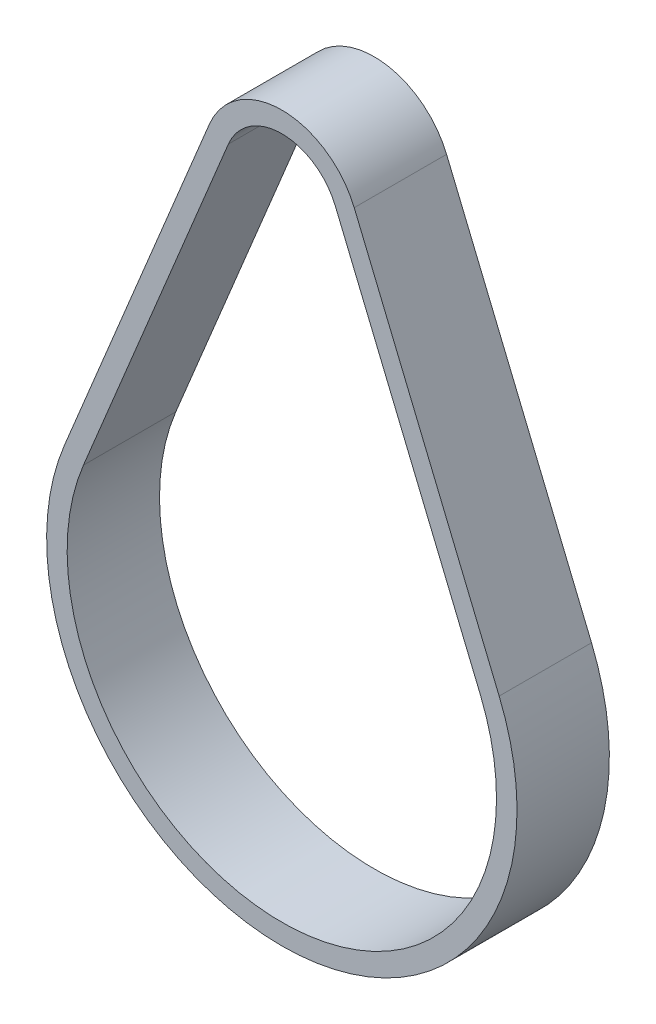
ISO-10303-21;
HEADER;
FILE_DESCRIPTION(('STEP AP214'),'2;1');
FILE_NAME('part.step','',(''),(''),'','','');
FILE_SCHEMA(('AUTOMOTIVE_DESIGN { 1 0 10303 214 1 1 1 1 }'));
ENDSEC;
DATA;
#1=APPLICATION_CONTEXT('core data for automotive mechanical design processes');
#2=APPLICATION_PROTOCOL_DEFINITION('international standard','automotive_design',2000,#1);
#3=PRODUCT_CONTEXT('',#1,'mechanical');
#4=PRODUCT('Part','Part','',(#3));
#5=PRODUCT_RELATED_PRODUCT_CATEGORY('part','',(#4));
#6=PRODUCT_DEFINITION_FORMATION('','',#4);
#7=PRODUCT_DEFINITION_CONTEXT('part definition',#1,'design');
#8=PRODUCT_DEFINITION('design','',#6,#7);
#9=PRODUCT_DEFINITION_SHAPE('','',#8);
#10=(LENGTH_UNIT() NAMED_UNIT(*) SI_UNIT(.MILLI.,.METRE.));
#11=(NAMED_UNIT(*) PLANE_ANGLE_UNIT() SI_UNIT($,.RADIAN.));
#12=(NAMED_UNIT(*) SI_UNIT($,.STERADIAN.) SOLID_ANGLE_UNIT());
#13=UNCERTAINTY_MEASURE_WITH_UNIT(LENGTH_MEASURE(1.E-05),#10,'distance_accuracy_value','');
#14=(GEOMETRIC_REPRESENTATION_CONTEXT(3) GLOBAL_UNCERTAINTY_ASSIGNED_CONTEXT((#13)) GLOBAL_UNIT_ASSIGNED_CONTEXT((#10,
#11,#12)) REPRESENTATION_CONTEXT('',''));
#15=CARTESIAN_POINT('',(0.,0.,0.));
#16=DIRECTION('',(0.,0.,1.));
#17=DIRECTION('',(1.,0.,0.));
#18=AXIS2_PLACEMENT_3D('',#15,#16,#17);
#19=CARTESIAN_POINT('',(0.,0.,4.5));
#20=DIRECTION('',(0.,0.,1.));
#21=DIRECTION('',(1.,0.,0.));
#22=AXIS2_PLACEMENT_3D('',#19,#20,#21);
#23=PLANE('',#22);
#24=CARTESIAN_POINT('',(0.,0.,4.5));
#25=DIRECTION('',(0.,0.,1.));
#26=DIRECTION('',(1.,0.,0.));
#27=AXIS2_PLACEMENT_3D('',#24,#25,#26);
#28=CIRCLE('',#27,7.635);
#29=CARTESIAN_POINT('',(7.05558477528836,2.917524375,4.5));
#30=VERTEX_POINT('',#29);
#31=CARTESIAN_POINT('',(-7.05558477528836,2.917524375,4.5));
#32=VERTEX_POINT('',#31);
#33=EDGE_CURVE('E164',#30,#32,#28,.T.);
#34=ORIENTED_EDGE('',*,*,#33,.T.);
#35=DIRECTION('',(-0.382125,-0.924110645093432,0.));
#36=VECTOR('',#35,1.);
#37=CARTESIAN_POINT('',(-7.05558477528836,2.917524375,4.5));
#38=LINE('',#37,#36);
#39=CARTESIAN_POINT('',(-21.1806159855415,-31.241695,4.5));
#40=VERTEX_POINT('',#39);
#41=EDGE_CURVE('E167',#32,#40,#38,.T.);
#42=ORIENTED_EDGE('',*,*,#41,.T.);
#43=CARTESIAN_POINT('',(0.,-40.,4.5));
#44=DIRECTION('',(0.,0.,1.));
#45=DIRECTION('',(1.,0.,0.));
#46=AXIS2_PLACEMENT_3D('',#43,#44,#45);
#47=CIRCLE('',#46,22.92);
#48=CARTESIAN_POINT('',(21.1806159855415,-31.241695,4.5));
#49=VERTEX_POINT('',#48);
#50=EDGE_CURVE('E170',#40,#49,#47,.T.);
#51=ORIENTED_EDGE('',*,*,#50,.T.);
#52=DIRECTION('',(-0.382125,0.924110645093432,0.));
#53=VECTOR('',#52,1.);
#54=CARTESIAN_POINT('',(7.05558477528836,2.917524375,4.5));
#55=LINE('',#54,#53);
#56=EDGE_CURVE('E172',#49,#30,#55,.T.);
#57=ORIENTED_EDGE('',*,*,#56,.T.);
#58=EDGE_LOOP('',(#34,#42,#51,#57));
#59=FACE_BOUND('',#58,.T.);
#60=DIRECTION('',(-0.382125,-0.924110645093433,0.));
#61=VECTOR('',#60,1.);
#62=CARTESIAN_POINT('',(-5.20736348510149,2.153274375,4.5));
#63=LINE('',#62,#61);
#64=CARTESIAN_POINT('',(-5.20736348510149,2.153274375,4.5));
#65=VERTEX_POINT('',#64);
#66=CARTESIAN_POINT('',(-19.3323946953546,-32.005945,4.5));
#67=VERTEX_POINT('',#66);
#68=EDGE_CURVE('E136',#65,#67,#63,.T.);
#69=ORIENTED_EDGE('',*,*,#68,.F.);
#70=CARTESIAN_POINT('',(0.,0.,4.5));
#71=DIRECTION('',(0.,0.,1.));
#72=DIRECTION('',(1.,0.,0.));
#73=AXIS2_PLACEMENT_3D('',#70,#71,#72);
#74=CIRCLE('',#73,5.635);
#75=CARTESIAN_POINT('',(5.20736348510149,2.153274375,4.5));
#76=VERTEX_POINT('',#75);
#77=EDGE_CURVE('E128',#76,#65,#74,.T.);
#78=ORIENTED_EDGE('',*,*,#77,.F.);
#79=DIRECTION('',(-0.382125,0.924110645093433,0.));
#80=VECTOR('',#79,1.);
#81=CARTESIAN_POINT('',(5.20736348510149,2.153274375,4.5));
#82=LINE('',#81,#80);
#83=CARTESIAN_POINT('',(19.3323946953546,-32.005945,4.5));
#84=VERTEX_POINT('',#83);
#85=EDGE_CURVE('E150',#84,#76,#82,.T.);
#86=ORIENTED_EDGE('',*,*,#85,.F.);
#87=CARTESIAN_POINT('',(0.,-40.,4.5));
#88=DIRECTION('',(0.,0.,1.));
#89=DIRECTION('',(1.,0.,0.));
#90=AXIS2_PLACEMENT_3D('',#87,#88,#89);
#91=CIRCLE('',#90,20.92);
#92=EDGE_CURVE('E148',#67,#84,#91,.T.);
#93=ORIENTED_EDGE('',*,*,#92,.F.);
#94=EDGE_LOOP('',(#69,#78,#86,#93));
#95=FACE_BOUND('',#94,.T.);
#96=ADVANCED_FACE('F63',(#59,#95),#23,.T.);
#97=CARTESIAN_POINT('',(0.,0.,-4.5));
#98=DIRECTION('',(0.,0.,1.));
#99=DIRECTION('',(1.,0.,0.));
#100=AXIS2_PLACEMENT_3D('',#97,#98,#99);
#101=PLANE('',#100);
#102=CARTESIAN_POINT('',(0.,0.,-4.5));
#103=DIRECTION('',(0.,0.,1.));
#104=DIRECTION('',(1.,0.,0.));
#105=AXIS2_PLACEMENT_3D('',#102,#103,#104);
#106=CIRCLE('',#105,7.635);
#107=CARTESIAN_POINT('',(7.05558477528836,2.917524375,-4.5));
#108=VERTEX_POINT('',#107);
#109=CARTESIAN_POINT('',(-7.05558477528836,2.917524375,-4.5));
#110=VERTEX_POINT('',#109);
#111=EDGE_CURVE('E144',#108,#110,#106,.T.);
#112=ORIENTED_EDGE('',*,*,#111,.F.);
#113=DIRECTION('',(-0.382125,0.924110645093432,0.));
#114=VECTOR('',#113,1.);
#115=CARTESIAN_POINT('',(7.05558477528836,2.917524375,-4.5));
#116=LINE('',#115,#114);
#117=CARTESIAN_POINT('',(21.1806159855415,-31.241695,-4.5));
#118=VERTEX_POINT('',#117);
#119=EDGE_CURVE('E168',#118,#108,#116,.T.);
#120=ORIENTED_EDGE('',*,*,#119,.F.);
#121=CARTESIAN_POINT('',(0.,-40.,-4.5));
#122=DIRECTION('',(0.,0.,1.));
#123=DIRECTION('',(1.,0.,0.));
#124=AXIS2_PLACEMENT_3D('',#121,#122,#123);
#125=CIRCLE('',#124,22.92);
#126=CARTESIAN_POINT('',(-21.1806159855415,-31.241695,-4.5));
#127=VERTEX_POINT('',#126);
#128=EDGE_CURVE('E179',#127,#118,#125,.T.);
#129=ORIENTED_EDGE('',*,*,#128,.F.);
#130=DIRECTION('',(-0.382125,-0.924110645093432,0.));
#131=VECTOR('',#130,1.);
#132=CARTESIAN_POINT('',(-7.05558477528836,2.917524375,-4.5));
#133=LINE('',#132,#131);
#134=EDGE_CURVE('E177',#110,#127,#133,.T.);
#135=ORIENTED_EDGE('',*,*,#134,.F.);
#136=EDGE_LOOP('',(#112,#120,#129,#135));
#137=FACE_BOUND('',#136,.T.);
#138=CARTESIAN_POINT('',(0.,0.,-4.5));
#139=DIRECTION('',(0.,0.,1.));
#140=DIRECTION('',(1.,0.,0.));
#141=AXIS2_PLACEMENT_3D('',#138,#139,#140);
#142=CIRCLE('',#141,5.635);
#143=CARTESIAN_POINT('',(5.20736348510149,2.153274375,-4.5));
#144=VERTEX_POINT('',#143);
#145=CARTESIAN_POINT('',(-5.20736348510149,2.153274375,-4.5));
#146=VERTEX_POINT('',#145);
#147=EDGE_CURVE('E86',#144,#146,#142,.T.);
#148=ORIENTED_EDGE('',*,*,#147,.T.);
#149=DIRECTION('',(-0.382125,-0.924110645093433,0.));
#150=VECTOR('',#149,1.);
#151=CARTESIAN_POINT('',(-5.20736348510149,2.153274375,-4.5));
#152=LINE('',#151,#150);
#153=CARTESIAN_POINT('',(-19.3323946953546,-32.005945,-4.5));
#154=VERTEX_POINT('',#153);
#155=EDGE_CURVE('E143',#146,#154,#152,.T.);
#156=ORIENTED_EDGE('',*,*,#155,.T.);
#157=CARTESIAN_POINT('',(0.,-40.,-4.5));
#158=DIRECTION('',(0.,0.,1.));
#159=DIRECTION('',(1.,0.,0.));
#160=AXIS2_PLACEMENT_3D('',#157,#158,#159);
#161=CIRCLE('',#160,20.92);
#162=CARTESIAN_POINT('',(19.3323946953546,-32.005945,-4.5));
#163=VERTEX_POINT('',#162);
#164=EDGE_CURVE('E156',#154,#163,#161,.T.);
#165=ORIENTED_EDGE('',*,*,#164,.T.);
#166=DIRECTION('',(-0.382125,0.924110645093433,0.));
#167=VECTOR('',#166,1.);
#168=CARTESIAN_POINT('',(5.20736348510149,2.153274375,-4.5));
#169=LINE('',#168,#167);
#170=EDGE_CURVE('E137',#163,#144,#169,.T.);
#171=ORIENTED_EDGE('',*,*,#170,.T.);
#172=EDGE_LOOP('',(#148,#156,#165,#171));
#173=FACE_BOUND('',#172,.T.);
#174=ADVANCED_FACE('F197',(#137,#173),#101,.F.);
#175=CARTESIAN_POINT('',(0.,0.,4.5));
#176=DIRECTION('',(0.,0.,-1.));
#177=DIRECTION('',(-1.,0.,0.));
#178=AXIS2_PLACEMENT_3D('',#175,#176,#177);
#179=CYLINDRICAL_SURFACE('',#178,7.635);
#180=ORIENTED_EDGE('',*,*,#111,.T.);
#181=DIRECTION('',(0.,0.,-1.));
#182=VECTOR('',#181,1.);
#183=CARTESIAN_POINT('',(-7.05558477528836,2.917524375,4.5));
#184=LINE('',#183,#182);
#185=EDGE_CURVE('E12',#32,#110,#184,.T.);
#186=ORIENTED_EDGE('',*,*,#185,.F.);
#187=ORIENTED_EDGE('',*,*,#33,.F.);
#188=DIRECTION('',(0.,0.,-1.));
#189=VECTOR('',#188,1.);
#190=CARTESIAN_POINT('',(7.05558477528836,2.917524375,4.5));
#191=LINE('',#190,#189);
#192=EDGE_CURVE('E174',#30,#108,#191,.T.);
#193=ORIENTED_EDGE('',*,*,#192,.T.);
#194=EDGE_LOOP('',(#180,#186,#187,#193));
#195=FACE_BOUND('',#194,.T.);
#196=ADVANCED_FACE('F65',(#195),#179,.T.);
#197=CARTESIAN_POINT('',(-7.05558477528836,2.917524375,4.5));
#198=DIRECTION('',(0.924110645093432,-0.382125,0.));
#199=DIRECTION('',(0.382125,0.924110645093432,0.));
#200=AXIS2_PLACEMENT_3D('',#197,#198,#199);
#201=PLANE('',#200);
#202=ORIENTED_EDGE('',*,*,#134,.T.);
#203=DIRECTION('',(0.,0.,-1.));
#204=VECTOR('',#203,1.);
#205=CARTESIAN_POINT('',(-21.1806159855415,-31.241695,4.5));
#206=LINE('',#205,#204);
#207=EDGE_CURVE('E71',#40,#127,#206,.T.);
#208=ORIENTED_EDGE('',*,*,#207,.F.);
#209=ORIENTED_EDGE('',*,*,#41,.F.);
#210=ORIENTED_EDGE('',*,*,#185,.T.);
#211=EDGE_LOOP('',(#202,#208,#209,#210));
#212=FACE_BOUND('',#211,.T.);
#213=ADVANCED_FACE('F207',(#212),#201,.F.);
#214=CARTESIAN_POINT('',(0.,-40.,4.5));
#215=DIRECTION('',(0.,0.,-1.));
#216=DIRECTION('',(-1.,0.,0.));
#217=AXIS2_PLACEMENT_3D('',#214,#215,#216);
#218=CYLINDRICAL_SURFACE('',#217,22.92);
#219=ORIENTED_EDGE('',*,*,#128,.T.);
#220=DIRECTION('',(0.,0.,-1.));
#221=VECTOR('',#220,1.);
#222=CARTESIAN_POINT('',(21.1806159855415,-31.241695,4.5));
#223=LINE('',#222,#221);
#224=EDGE_CURVE('E184',#49,#118,#223,.T.);
#225=ORIENTED_EDGE('',*,*,#224,.F.);
#226=ORIENTED_EDGE('',*,*,#50,.F.);
#227=ORIENTED_EDGE('',*,*,#207,.T.);
#228=EDGE_LOOP('',(#219,#225,#226,#227));
#229=FACE_BOUND('',#228,.T.);
#230=ADVANCED_FACE('F191',(#229),#218,.T.);
#231=CARTESIAN_POINT('',(7.05558477528836,2.917524375,4.5));
#232=DIRECTION('',(-0.924110645093432,-0.382125,0.));
#233=DIRECTION('',(0.382125,-0.924110645093432,0.));
#234=AXIS2_PLACEMENT_3D('',#231,#232,#233);
#235=PLANE('',#234);
#236=ORIENTED_EDGE('',*,*,#119,.T.);
#237=ORIENTED_EDGE('',*,*,#192,.F.);
#238=ORIENTED_EDGE('',*,*,#56,.F.);
#239=ORIENTED_EDGE('',*,*,#224,.T.);
#240=EDGE_LOOP('',(#236,#237,#238,#239));
#241=FACE_BOUND('',#240,.T.);
#242=ADVANCED_FACE('F201',(#241),#235,.F.);
#243=CARTESIAN_POINT('',(0.,0.,4.5));
#244=DIRECTION('',(0.,0.,-1.));
#245=DIRECTION('',(-1.,0.,0.));
#246=AXIS2_PLACEMENT_3D('',#243,#244,#245);
#247=CYLINDRICAL_SURFACE('',#246,5.635);
#248=ORIENTED_EDGE('',*,*,#147,.F.);
#249=DIRECTION('',(0.,0.,-1.));
#250=VECTOR('',#249,1.);
#251=CARTESIAN_POINT('',(5.20736348510149,2.153274375,4.5));
#252=LINE('',#251,#250);
#253=EDGE_CURVE('E132',#76,#144,#252,.T.);
#254=ORIENTED_EDGE('',*,*,#253,.F.);
#255=ORIENTED_EDGE('',*,*,#77,.T.);
#256=DIRECTION('',(0.,0.,-1.));
#257=VECTOR('',#256,1.);
#258=CARTESIAN_POINT('',(-5.20736348510149,2.153274375,4.5));
#259=LINE('',#258,#257);
#260=EDGE_CURVE('E131',#65,#146,#259,.T.);
#261=ORIENTED_EDGE('',*,*,#260,.T.);
#262=EDGE_LOOP('',(#248,#254,#255,#261));
#263=FACE_BOUND('',#262,.T.);
#264=ADVANCED_FACE('F130',(#263),#247,.F.);
#265=CARTESIAN_POINT('',(-5.20736348510149,2.153274375,4.5));
#266=DIRECTION('',(0.924110645093432,-0.382125,0.));
#267=DIRECTION('',(0.382125,0.924110645093433,0.));
#268=AXIS2_PLACEMENT_3D('',#265,#266,#267);
#269=PLANE('',#268);
#270=ORIENTED_EDGE('',*,*,#155,.F.);
#271=ORIENTED_EDGE('',*,*,#260,.F.);
#272=ORIENTED_EDGE('',*,*,#68,.T.);
#273=DIRECTION('',(0.,0.,-1.));
#274=VECTOR('',#273,1.);
#275=CARTESIAN_POINT('',(-19.3323946953546,-32.005945,4.5));
#276=LINE('',#275,#274);
#277=EDGE_CURVE('E145',#67,#154,#276,.T.);
#278=ORIENTED_EDGE('',*,*,#277,.T.);
#279=EDGE_LOOP('',(#270,#271,#272,#278));
#280=FACE_BOUND('',#279,.T.);
#281=ADVANCED_FACE('F140',(#280),#269,.T.);
#282=CARTESIAN_POINT('',(0.,-40.,4.5));
#283=DIRECTION('',(0.,0.,-1.));
#284=DIRECTION('',(-1.,0.,0.));
#285=AXIS2_PLACEMENT_3D('',#282,#283,#284);
#286=CYLINDRICAL_SURFACE('',#285,20.92);
#287=ORIENTED_EDGE('',*,*,#164,.F.);
#288=ORIENTED_EDGE('',*,*,#277,.F.);
#289=ORIENTED_EDGE('',*,*,#92,.T.);
#290=DIRECTION('',(0.,0.,-1.));
#291=VECTOR('',#290,1.);
#292=CARTESIAN_POINT('',(19.3323946953546,-32.005945,4.5));
#293=LINE('',#292,#291);
#294=EDGE_CURVE('E78',#84,#163,#293,.T.);
#295=ORIENTED_EDGE('',*,*,#294,.T.);
#296=EDGE_LOOP('',(#287,#288,#289,#295));
#297=FACE_BOUND('',#296,.T.);
#298=ADVANCED_FACE('F230',(#297),#286,.F.);
#299=CARTESIAN_POINT('',(5.20736348510149,2.153274375,4.5));
#300=DIRECTION('',(-0.924110645093432,-0.382125,0.));
#301=DIRECTION('',(0.382125,-0.924110645093433,0.));
#302=AXIS2_PLACEMENT_3D('',#299,#300,#301);
#303=PLANE('',#302);
#304=ORIENTED_EDGE('',*,*,#170,.F.);
#305=ORIENTED_EDGE('',*,*,#294,.F.);
#306=ORIENTED_EDGE('',*,*,#85,.T.);
#307=ORIENTED_EDGE('',*,*,#253,.T.);
#308=EDGE_LOOP('',(#304,#305,#306,#307));
#309=FACE_BOUND('',#308,.T.);
#310=ADVANCED_FACE('F234',(#309),#303,.T.);
#311=CLOSED_SHELL('',(#96,#174,#196,#213,#230,#242,#264,#281,#298,#310));
#312=MANIFOLD_SOLID_BREP('B2',#311);
#313=ADVANCED_BREP_SHAPE_REPRESENTATION('',(#18,#312),#14);
#314=SHAPE_DEFINITION_REPRESENTATION(#9,#313);
ENDSEC;
END-ISO-10303-21;
